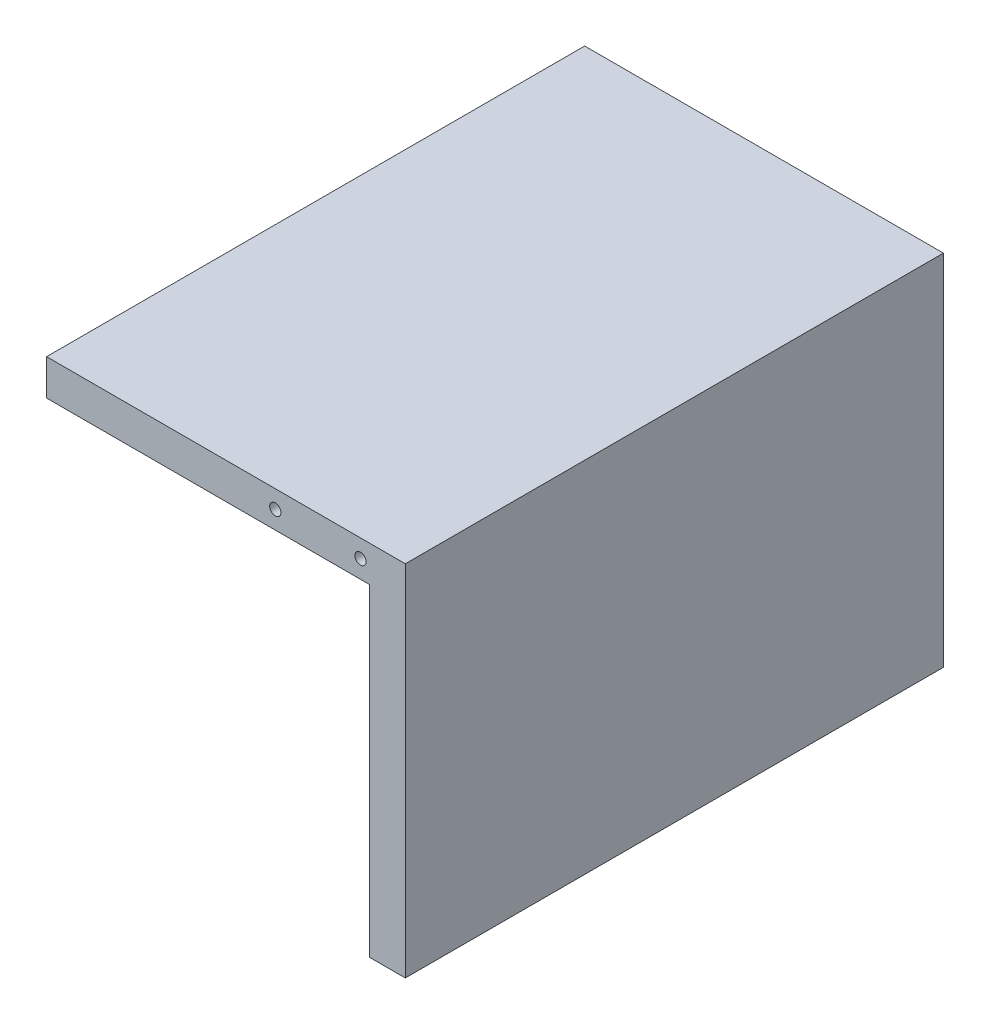
ISO-10303-21;
HEADER;
FILE_DESCRIPTION(('STEP AP214'),'2;1');
FILE_NAME('part.step','',(''),(''),'','','');
FILE_SCHEMA(('AUTOMOTIVE_DESIGN { 1 0 10303 214 1 1 1 1 }'));
ENDSEC;
DATA;
#1=APPLICATION_CONTEXT('core data for automotive mechanical design processes');
#2=APPLICATION_PROTOCOL_DEFINITION('international standard','automotive_design',2000,#1);
#3=PRODUCT_CONTEXT('',#1,'mechanical');
#4=PRODUCT('Part','Part','',(#3));
#5=PRODUCT_RELATED_PRODUCT_CATEGORY('part','',(#4));
#6=PRODUCT_DEFINITION_FORMATION('','',#4);
#7=PRODUCT_DEFINITION_CONTEXT('part definition',#1,'design');
#8=PRODUCT_DEFINITION('design','',#6,#7);
#9=PRODUCT_DEFINITION_SHAPE('','',#8);
#10=(LENGTH_UNIT() NAMED_UNIT(*) SI_UNIT(.MILLI.,.METRE.));
#11=(NAMED_UNIT(*) PLANE_ANGLE_UNIT() SI_UNIT($,.RADIAN.));
#12=(NAMED_UNIT(*) SI_UNIT($,.STERADIAN.) SOLID_ANGLE_UNIT());
#13=UNCERTAINTY_MEASURE_WITH_UNIT(LENGTH_MEASURE(1.E-05),#10,'distance_accuracy_value','');
#14=(GEOMETRIC_REPRESENTATION_CONTEXT(3) GLOBAL_UNCERTAINTY_ASSIGNED_CONTEXT((#13)) GLOBAL_UNIT_ASSIGNED_CONTEXT((#10,
#11,#12)) REPRESENTATION_CONTEXT('',''));
#15=CARTESIAN_POINT('',(0.,0.,0.));
#16=DIRECTION('',(0.,0.,1.));
#17=DIRECTION('',(1.,0.,0.));
#18=AXIS2_PLACEMENT_3D('',#15,#16,#17);
#19=CARTESIAN_POINT('',(0.,-80.,120.));
#20=DIRECTION('',(-1.,0.,0.));
#21=DIRECTION('',(0.,0.,1.));
#22=AXIS2_PLACEMENT_3D('',#19,#20,#21);
#23=PLANE('',#22);
#24=DIRECTION('',(0.,1.,0.));
#25=VECTOR('',#24,1.);
#26=CARTESIAN_POINT('',(0.,-80.,0.));
#27=LINE('',#26,#25);
#28=CARTESIAN_POINT('',(0.,-80.,0.));
#29=VERTEX_POINT('',#28);
#30=CARTESIAN_POINT('',(0.,0.,0.));
#31=VERTEX_POINT('',#30);
#32=EDGE_CURVE('E126',#29,#31,#27,.T.);
#33=ORIENTED_EDGE('',*,*,#32,.T.);
#34=DIRECTION('',(0.,0.,-1.));
#35=VECTOR('',#34,1.);
#36=CARTESIAN_POINT('',(0.,0.,120.));
#37=LINE('',#36,#35);
#38=CARTESIAN_POINT('',(0.,0.,120.));
#39=VERTEX_POINT('',#38);
#40=EDGE_CURVE('E11',#39,#31,#37,.T.);
#41=ORIENTED_EDGE('',*,*,#40,.F.);
#42=DIRECTION('',(0.,1.,0.));
#43=VECTOR('',#42,1.);
#44=CARTESIAN_POINT('',(0.,-80.,120.));
#45=LINE('',#44,#43);
#46=CARTESIAN_POINT('',(0.,-80.,120.));
#47=VERTEX_POINT('',#46);
#48=EDGE_CURVE('E137',#47,#39,#45,.T.);
#49=ORIENTED_EDGE('',*,*,#48,.F.);
#50=DIRECTION('',(0.,0.,-1.));
#51=VECTOR('',#50,1.);
#52=CARTESIAN_POINT('',(0.,-80.,120.));
#53=LINE('',#52,#51);
#54=EDGE_CURVE('E122',#47,#29,#53,.T.);
#55=ORIENTED_EDGE('',*,*,#54,.T.);
#56=EDGE_LOOP('',(#33,#41,#49,#55));
#57=FACE_BOUND('',#56,.T.);
#58=ADVANCED_FACE('F39',(#57),#23,.F.);
#59=CARTESIAN_POINT('',(0.,0.,120.));
#60=DIRECTION('',(0.,-1.,0.));
#61=DIRECTION('',(1.,0.,0.));
#62=AXIS2_PLACEMENT_3D('',#59,#60,#61);
#63=PLANE('',#62);
#64=DIRECTION('',(-1.,0.,0.));
#65=VECTOR('',#64,1.);
#66=CARTESIAN_POINT('',(0.,0.,0.));
#67=LINE('',#66,#65);
#68=CARTESIAN_POINT('',(-80.,0.,0.));
#69=VERTEX_POINT('',#68);
#70=EDGE_CURVE('E129',#31,#69,#67,.T.);
#71=ORIENTED_EDGE('',*,*,#70,.T.);
#72=DIRECTION('',(0.,0.,-1.));
#73=VECTOR('',#72,1.);
#74=CARTESIAN_POINT('',(-80.,0.,120.));
#75=LINE('',#74,#73);
#76=CARTESIAN_POINT('',(-80.,0.,120.));
#77=VERTEX_POINT('',#76);
#78=EDGE_CURVE('E47',#77,#69,#75,.T.);
#79=ORIENTED_EDGE('',*,*,#78,.F.);
#80=DIRECTION('',(-1.,0.,0.));
#81=VECTOR('',#80,1.);
#82=CARTESIAN_POINT('',(0.,0.,120.));
#83=LINE('',#82,#81);
#84=EDGE_CURVE('E93',#39,#77,#83,.T.);
#85=ORIENTED_EDGE('',*,*,#84,.F.);
#86=ORIENTED_EDGE('',*,*,#40,.T.);
#87=EDGE_LOOP('',(#71,#79,#85,#86));
#88=FACE_BOUND('',#87,.T.);
#89=ADVANCED_FACE('F162',(#88),#63,.F.);
#90=CARTESIAN_POINT('',(-80.,0.,120.));
#91=DIRECTION('',(1.,0.,0.));
#92=DIRECTION('',(0.,0.,-1.));
#93=AXIS2_PLACEMENT_3D('',#90,#91,#92);
#94=PLANE('',#93);
#95=DIRECTION('',(0.,-1.,0.));
#96=VECTOR('',#95,1.);
#97=CARTESIAN_POINT('',(-80.,0.,0.));
#98=LINE('',#97,#96);
#99=CARTESIAN_POINT('',(-80.,-8.00000000000001,0.));
#100=VERTEX_POINT('',#99);
#101=EDGE_CURVE('E132',#69,#100,#98,.T.);
#102=ORIENTED_EDGE('',*,*,#101,.T.);
#103=DIRECTION('',(0.,0.,-1.));
#104=VECTOR('',#103,1.);
#105=CARTESIAN_POINT('',(-80.,-8.00000000000001,120.));
#106=LINE('',#105,#104);
#107=CARTESIAN_POINT('',(-80.,-8.00000000000001,120.));
#108=VERTEX_POINT('',#107);
#109=EDGE_CURVE('E117',#108,#100,#106,.T.);
#110=ORIENTED_EDGE('',*,*,#109,.F.);
#111=DIRECTION('',(0.,-1.,0.));
#112=VECTOR('',#111,1.);
#113=CARTESIAN_POINT('',(-80.,0.,120.));
#114=LINE('',#113,#112);
#115=EDGE_CURVE('E108',#77,#108,#114,.T.);
#116=ORIENTED_EDGE('',*,*,#115,.F.);
#117=ORIENTED_EDGE('',*,*,#78,.T.);
#118=EDGE_LOOP('',(#102,#110,#116,#117));
#119=FACE_BOUND('',#118,.T.);
#120=ADVANCED_FACE('F143',(#119),#94,.F.);
#121=CARTESIAN_POINT('',(-80.,-8.00000000000001,120.));
#122=DIRECTION('',(0.,1.,0.));
#123=DIRECTION('',(0.,0.,1.));
#124=AXIS2_PLACEMENT_3D('',#121,#122,#123);
#125=PLANE('',#124);
#126=DIRECTION('',(1.,0.,0.));
#127=VECTOR('',#126,1.);
#128=CARTESIAN_POINT('',(-80.,-8.00000000000001,0.));
#129=LINE('',#128,#127);
#130=CARTESIAN_POINT('',(-8.00000000000001,-8.00000000000001,0.));
#131=VERTEX_POINT('',#130);
#132=EDGE_CURVE('E116',#100,#131,#129,.T.);
#133=ORIENTED_EDGE('',*,*,#132,.T.);
#134=DIRECTION('',(0.,0.,-1.));
#135=VECTOR('',#134,1.);
#136=CARTESIAN_POINT('',(-8.00000000000001,-8.00000000000001,120.));
#137=LINE('',#136,#135);
#138=CARTESIAN_POINT('',(-8.00000000000001,-8.00000000000001,120.));
#139=VERTEX_POINT('',#138);
#140=EDGE_CURVE('E113',#139,#131,#137,.T.);
#141=ORIENTED_EDGE('',*,*,#140,.F.);
#142=DIRECTION('',(1.,0.,0.));
#143=VECTOR('',#142,1.);
#144=CARTESIAN_POINT('',(-80.,-8.00000000000001,120.));
#145=LINE('',#144,#143);
#146=EDGE_CURVE('E102',#108,#139,#145,.T.);
#147=ORIENTED_EDGE('',*,*,#146,.F.);
#148=ORIENTED_EDGE('',*,*,#109,.T.);
#149=EDGE_LOOP('',(#133,#141,#147,#148));
#150=FACE_BOUND('',#149,.T.);
#151=ADVANCED_FACE('F114',(#150),#125,.F.);
#152=CARTESIAN_POINT('',(-8.00000000000001,-8.00000000000001,120.));
#153=DIRECTION('',(1.,0.,0.));
#154=DIRECTION('',(0.,1.,0.));
#155=AXIS2_PLACEMENT_3D('',#152,#153,#154);
#156=PLANE('',#155);
#157=DIRECTION('',(0.,-1.,0.));
#158=VECTOR('',#157,1.);
#159=CARTESIAN_POINT('',(-8.00000000000001,-8.00000000000001,0.));
#160=LINE('',#159,#158);
#161=CARTESIAN_POINT('',(-8.,-80.,0.));
#162=VERTEX_POINT('',#161);
#163=EDGE_CURVE('E79',#131,#162,#160,.T.);
#164=ORIENTED_EDGE('',*,*,#163,.T.);
#165=DIRECTION('',(0.,0.,-1.));
#166=VECTOR('',#165,1.);
#167=CARTESIAN_POINT('',(-8.,-80.,120.));
#168=LINE('',#167,#166);
#169=CARTESIAN_POINT('',(-8.,-80.,120.));
#170=VERTEX_POINT('',#169);
#171=EDGE_CURVE('E118',#170,#162,#168,.T.);
#172=ORIENTED_EDGE('',*,*,#171,.F.);
#173=DIRECTION('',(0.,-1.,0.));
#174=VECTOR('',#173,1.);
#175=CARTESIAN_POINT('',(-8.00000000000001,-8.00000000000001,120.));
#176=LINE('',#175,#174);
#177=EDGE_CURVE('E106',#139,#170,#176,.T.);
#178=ORIENTED_EDGE('',*,*,#177,.F.);
#179=ORIENTED_EDGE('',*,*,#140,.T.);
#180=EDGE_LOOP('',(#164,#172,#178,#179));
#181=FACE_BOUND('',#180,.T.);
#182=ADVANCED_FACE('F120',(#181),#156,.F.);
#183=CARTESIAN_POINT('',(-8.,-80.,120.));
#184=DIRECTION('',(0.,1.,0.));
#185=DIRECTION('',(0.,0.,1.));
#186=AXIS2_PLACEMENT_3D('',#183,#184,#185);
#187=PLANE('',#186);
#188=DIRECTION('',(1.,0.,0.));
#189=VECTOR('',#188,1.);
#190=CARTESIAN_POINT('',(-8.,-80.,0.));
#191=LINE('',#190,#189);
#192=EDGE_CURVE('E85',#162,#29,#191,.T.);
#193=ORIENTED_EDGE('',*,*,#192,.T.);
#194=ORIENTED_EDGE('',*,*,#54,.F.);
#195=DIRECTION('',(1.,0.,0.));
#196=VECTOR('',#195,1.);
#197=CARTESIAN_POINT('',(-8.,-80.,120.));
#198=LINE('',#197,#196);
#199=EDGE_CURVE('E55',#170,#47,#198,.T.);
#200=ORIENTED_EDGE('',*,*,#199,.F.);
#201=ORIENTED_EDGE('',*,*,#171,.T.);
#202=EDGE_LOOP('',(#193,#194,#200,#201));
#203=FACE_BOUND('',#202,.T.);
#204=ADVANCED_FACE('F150',(#203),#187,.F.);
#205=CARTESIAN_POINT('',(0.,0.,120.));
#206=DIRECTION('',(0.,0.,1.));
#207=DIRECTION('',(1.,0.,0.));
#208=AXIS2_PLACEMENT_3D('',#205,#206,#207);
#209=PLANE('',#208);
#210=CARTESIAN_POINT('',(-10.,-4.00000000000002,120.));
#211=DIRECTION('',(0.,0.,1.));
#212=DIRECTION('',(1.,0.,0.));
#213=AXIS2_PLACEMENT_3D('',#210,#211,#212);
#214=CIRCLE('',#213,1.25);
#215=CARTESIAN_POINT('',(-8.75,-4.00000000000002,120.));
#216=VERTEX_POINT('',#215);
#217=EDGE_CURVE('E255',#216,#216,#214,.T.);
#218=ORIENTED_EDGE('',*,*,#217,.F.);
#219=EDGE_LOOP('',(#218));
#220=FACE_BOUND('',#219,.T.);
#221=CARTESIAN_POINT('',(-29.,-4.00000000000001,120.));
#222=DIRECTION('',(0.,0.,1.));
#223=DIRECTION('',(1.,0.,0.));
#224=AXIS2_PLACEMENT_3D('',#221,#222,#223);
#225=CIRCLE('',#224,1.25);
#226=CARTESIAN_POINT('',(-27.75,-4.00000000000001,120.));
#227=VERTEX_POINT('',#226);
#228=EDGE_CURVE('E257',#227,#227,#225,.T.);
#229=ORIENTED_EDGE('',*,*,#228,.F.);
#230=EDGE_LOOP('',(#229));
#231=FACE_BOUND('',#230,.T.);
#232=ORIENTED_EDGE('',*,*,#48,.T.);
#233=ORIENTED_EDGE('',*,*,#84,.T.);
#234=ORIENTED_EDGE('',*,*,#115,.T.);
#235=ORIENTED_EDGE('',*,*,#146,.T.);
#236=ORIENTED_EDGE('',*,*,#177,.T.);
#237=ORIENTED_EDGE('',*,*,#199,.T.);
#238=EDGE_LOOP('',(#232,#233,#234,#235,#236,#237));
#239=FACE_BOUND('',#238,.T.);
#240=ADVANCED_FACE('F104',(#220,#231,#239),#209,.T.);
#241=CARTESIAN_POINT('',(0.,0.,0.));
#242=DIRECTION('',(0.,0.,1.));
#243=DIRECTION('',(1.,0.,0.));
#244=AXIS2_PLACEMENT_3D('',#241,#242,#243);
#245=PLANE('',#244);
#246=ORIENTED_EDGE('',*,*,#32,.F.);
#247=ORIENTED_EDGE('',*,*,#192,.F.);
#248=ORIENTED_EDGE('',*,*,#163,.F.);
#249=ORIENTED_EDGE('',*,*,#132,.F.);
#250=ORIENTED_EDGE('',*,*,#101,.F.);
#251=ORIENTED_EDGE('',*,*,#70,.F.);
#252=EDGE_LOOP('',(#246,#247,#248,#249,#250,#251));
#253=FACE_BOUND('',#252,.T.);
#254=ADVANCED_FACE('F146',(#253),#245,.F.);
#255=CARTESIAN_POINT('',(-29.,-4.00000000000001,110.));
#256=DIRECTION('',(0.,0.,1.));
#257=DIRECTION('',(1.,0.,0.));
#258=AXIS2_PLACEMENT_3D('',#255,#256,#257);
#259=CONICAL_SURFACE('',#258,1.25,1.02974425867665);
#260=CARTESIAN_POINT('',(-29.,-4.00000000000001,109.248924226216));
#261=VERTEX_POINT('',#260);
#262=VERTEX_LOOP('',#261);
#263=FACE_BOUND('',#262,.T.);
#264=CARTESIAN_POINT('',(-29.,-4.00000000000001,110.));
#265=DIRECTION('',(0.,0.,1.));
#266=DIRECTION('',(1.,0.,0.));
#267=AXIS2_PLACEMENT_3D('',#264,#265,#266);
#268=CIRCLE('',#267,1.25);
#269=CARTESIAN_POINT('',(-27.75,-4.00000000000001,110.));
#270=VERTEX_POINT('',#269);
#271=EDGE_CURVE('E130',#270,#270,#268,.T.);
#272=ORIENTED_EDGE('',*,*,#271,.T.);
#273=EDGE_LOOP('',(#272));
#274=FACE_BOUND('',#273,.T.);
#275=ADVANCED_FACE('F194',(#263,#274),#259,.F.);
#276=CARTESIAN_POINT('',(-29.,-4.00000000000001,120.));
#277=DIRECTION('',(0.,0.,1.));
#278=DIRECTION('',(1.,0.,0.));
#279=AXIS2_PLACEMENT_3D('',#276,#277,#278);
#280=CYLINDRICAL_SURFACE('',#279,1.25);
#281=ORIENTED_EDGE('',*,*,#271,.F.);
#282=EDGE_LOOP('',(#281));
#283=FACE_BOUND('',#282,.T.);
#284=ORIENTED_EDGE('',*,*,#228,.T.);
#285=EDGE_LOOP('',(#284));
#286=FACE_BOUND('',#285,.T.);
#287=ADVANCED_FACE('F207',(#283,#286),#280,.F.);
#288=CARTESIAN_POINT('',(-10.,-4.00000000000002,110.));
#289=DIRECTION('',(0.,0.,1.));
#290=DIRECTION('',(1.,0.,0.));
#291=AXIS2_PLACEMENT_3D('',#288,#289,#290);
#292=CONICAL_SURFACE('',#291,1.25,1.02974425867665);
#293=CARTESIAN_POINT('',(-10.,-4.00000000000002,109.248924226216));
#294=VERTEX_POINT('',#293);
#295=VERTEX_LOOP('',#294);
#296=FACE_BOUND('',#295,.T.);
#297=CARTESIAN_POINT('',(-10.,-4.00000000000002,110.));
#298=DIRECTION('',(0.,0.,1.));
#299=DIRECTION('',(1.,0.,0.));
#300=AXIS2_PLACEMENT_3D('',#297,#298,#299);
#301=CIRCLE('',#300,1.25);
#302=CARTESIAN_POINT('',(-8.75,-4.00000000000002,110.));
#303=VERTEX_POINT('',#302);
#304=EDGE_CURVE('E252',#303,#303,#301,.T.);
#305=ORIENTED_EDGE('',*,*,#304,.T.);
#306=EDGE_LOOP('',(#305));
#307=FACE_BOUND('',#306,.T.);
#308=ADVANCED_FACE('F218',(#296,#307),#292,.F.);
#309=CARTESIAN_POINT('',(-10.,-4.00000000000002,120.));
#310=DIRECTION('',(0.,0.,1.));
#311=DIRECTION('',(1.,0.,0.));
#312=AXIS2_PLACEMENT_3D('',#309,#310,#311);
#313=CYLINDRICAL_SURFACE('',#312,1.25);
#314=ORIENTED_EDGE('',*,*,#304,.F.);
#315=EDGE_LOOP('',(#314));
#316=FACE_BOUND('',#315,.T.);
#317=ORIENTED_EDGE('',*,*,#217,.T.);
#318=EDGE_LOOP('',(#317));
#319=FACE_BOUND('',#318,.T.);
#320=ADVANCED_FACE('F230',(#316,#319),#313,.F.);
#321=CLOSED_SHELL('',(#58,#89,#120,#151,#182,#204,#240,#254,#275,#287,#308,#320));
#322=MANIFOLD_SOLID_BREP('B2',#321);
#323=ADVANCED_BREP_SHAPE_REPRESENTATION('',(#18,#322),#14);
#324=SHAPE_DEFINITION_REPRESENTATION(#9,#323);
ENDSEC;
END-ISO-10303-21;
